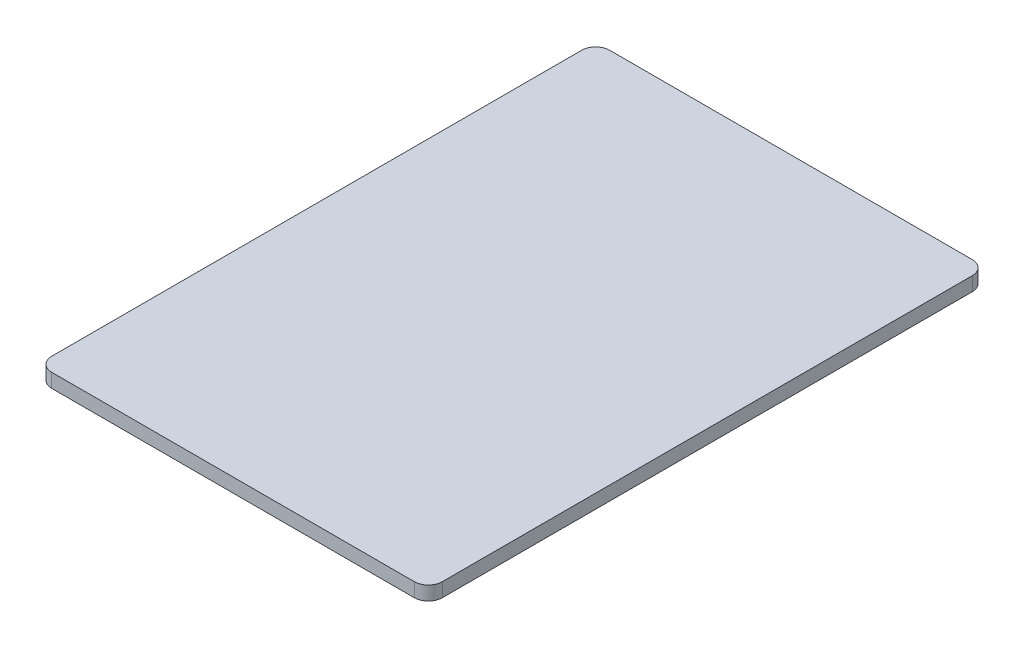
ISO-10303-21;
HEADER;
FILE_DESCRIPTION(('STEP AP214'),'2;1');
FILE_NAME('part.step','',(''),(''),'','','');
FILE_SCHEMA(('AUTOMOTIVE_DESIGN { 1 0 10303 214 1 1 1 1 }'));
ENDSEC;
DATA;
#1=APPLICATION_CONTEXT('core data for automotive mechanical design processes');
#2=APPLICATION_PROTOCOL_DEFINITION('international standard','automotive_design',2000,#1);
#3=PRODUCT_CONTEXT('',#1,'mechanical');
#4=PRODUCT('Part','Part','',(#3));
#5=PRODUCT_RELATED_PRODUCT_CATEGORY('part','',(#4));
#6=PRODUCT_DEFINITION_FORMATION('','',#4);
#7=PRODUCT_DEFINITION_CONTEXT('part definition',#1,'design');
#8=PRODUCT_DEFINITION('design','',#6,#7);
#9=PRODUCT_DEFINITION_SHAPE('','',#8);
#10=(LENGTH_UNIT() NAMED_UNIT(*) SI_UNIT(.MILLI.,.METRE.));
#11=(NAMED_UNIT(*) PLANE_ANGLE_UNIT() SI_UNIT($,.RADIAN.));
#12=(NAMED_UNIT(*) SI_UNIT($,.STERADIAN.) SOLID_ANGLE_UNIT());
#13=UNCERTAINTY_MEASURE_WITH_UNIT(LENGTH_MEASURE(1.E-05),#10,'distance_accuracy_value','');
#14=(GEOMETRIC_REPRESENTATION_CONTEXT(3) GLOBAL_UNCERTAINTY_ASSIGNED_CONTEXT((#13)) GLOBAL_UNIT_ASSIGNED_CONTEXT((#10,
#11,#12)) REPRESENTATION_CONTEXT('',''));
#15=CARTESIAN_POINT('',(0.,0.,0.));
#16=DIRECTION('',(0.,0.,1.));
#17=DIRECTION('',(1.,0.,0.));
#18=AXIS2_PLACEMENT_3D('',#15,#16,#17);
#19=CARTESIAN_POINT('',(-20.6375,1.5875,30.1625));
#20=DIRECTION('',(0.,-1.,0.));
#21=DIRECTION('',(0.,0.,-1.));
#22=AXIS2_PLACEMENT_3D('',#19,#20,#21);
#23=CYLINDRICAL_SURFACE('',#22,1.5875);
#24=CARTESIAN_POINT('',(-20.6375,0.,30.1625));
#25=DIRECTION('',(0.,1.,0.));
#26=DIRECTION('',(0.,0.,-1.));
#27=AXIS2_PLACEMENT_3D('',#24,#25,#26);
#28=CIRCLE('',#27,1.5875);
#29=CARTESIAN_POINT('',(-22.225,0.,30.1625));
#30=VERTEX_POINT('',#29);
#31=CARTESIAN_POINT('',(-20.6375,0.,31.75));
#32=VERTEX_POINT('',#31);
#33=EDGE_CURVE('E131',#30,#32,#28,.T.);
#34=ORIENTED_EDGE('',*,*,#33,.T.);
#35=DIRECTION('',(0.,-1.,0.));
#36=VECTOR('',#35,1.);
#37=CARTESIAN_POINT('',(-20.6375,1.5875,31.75));
#38=LINE('',#37,#36);
#39=CARTESIAN_POINT('',(-20.6375,1.5875,31.75));
#40=VERTEX_POINT('',#39);
#41=EDGE_CURVE('E11',#40,#32,#38,.T.);
#42=ORIENTED_EDGE('',*,*,#41,.F.);
#43=CARTESIAN_POINT('',(-20.6375,1.5875,30.1625));
#44=DIRECTION('',(0.,1.,0.));
#45=DIRECTION('',(0.,0.,-1.));
#46=AXIS2_PLACEMENT_3D('',#43,#44,#45);
#47=CIRCLE('',#46,1.5875);
#48=CARTESIAN_POINT('',(-22.225,1.5875,30.1625));
#49=VERTEX_POINT('',#48);
#50=EDGE_CURVE('E145',#49,#40,#47,.T.);
#51=ORIENTED_EDGE('',*,*,#50,.F.);
#52=DIRECTION('',(0.,-1.,0.));
#53=VECTOR('',#52,1.);
#54=CARTESIAN_POINT('',(-22.225,1.5875,30.1625));
#55=LINE('',#54,#53);
#56=EDGE_CURVE('E127',#49,#30,#55,.T.);
#57=ORIENTED_EDGE('',*,*,#56,.T.);
#58=EDGE_LOOP('',(#34,#42,#51,#57));
#59=FACE_BOUND('',#58,.T.);
#60=ADVANCED_FACE('F35',(#59),#23,.T.);
#61=CARTESIAN_POINT('',(-20.6375,1.5875,31.75));
#62=DIRECTION('',(0.,0.,-1.));
#63=DIRECTION('',(-1.,0.,0.));
#64=AXIS2_PLACEMENT_3D('',#61,#62,#63);
#65=PLANE('',#64);
#66=DIRECTION('',(1.,0.,0.));
#67=VECTOR('',#66,1.);
#68=CARTESIAN_POINT('',(-20.6375,0.,31.75));
#69=LINE('',#68,#67);
#70=CARTESIAN_POINT('',(20.6375,0.,31.75));
#71=VERTEX_POINT('',#70);
#72=EDGE_CURVE('E134',#32,#71,#69,.T.);
#73=ORIENTED_EDGE('',*,*,#72,.T.);
#74=DIRECTION('',(0.,-1.,0.));
#75=VECTOR('',#74,1.);
#76=CARTESIAN_POINT('',(20.6375,1.5875,31.75));
#77=LINE('',#76,#75);
#78=CARTESIAN_POINT('',(20.6375,1.5875,31.75));
#79=VERTEX_POINT('',#78);
#80=EDGE_CURVE('E43',#79,#71,#77,.T.);
#81=ORIENTED_EDGE('',*,*,#80,.F.);
#82=DIRECTION('',(1.,0.,0.));
#83=VECTOR('',#82,1.);
#84=CARTESIAN_POINT('',(-20.6375,1.5875,31.75));
#85=LINE('',#84,#83);
#86=EDGE_CURVE('E94',#40,#79,#85,.T.);
#87=ORIENTED_EDGE('',*,*,#86,.F.);
#88=ORIENTED_EDGE('',*,*,#41,.T.);
#89=EDGE_LOOP('',(#73,#81,#87,#88));
#90=FACE_BOUND('',#89,.T.);
#91=ADVANCED_FACE('F180',(#90),#65,.F.);
#92=CARTESIAN_POINT('',(20.6375,1.5875,30.1625));
#93=DIRECTION('',(0.,-1.,0.));
#94=DIRECTION('',(0.,0.,-1.));
#95=AXIS2_PLACEMENT_3D('',#92,#93,#94);
#96=CYLINDRICAL_SURFACE('',#95,1.5875);
#97=CARTESIAN_POINT('',(20.6375,0.,30.1625));
#98=DIRECTION('',(0.,1.,0.));
#99=DIRECTION('',(0.,0.,1.));
#100=AXIS2_PLACEMENT_3D('',#97,#98,#99);
#101=CIRCLE('',#100,1.5875);
#102=CARTESIAN_POINT('',(22.225,0.,30.1625));
#103=VERTEX_POINT('',#102);
#104=EDGE_CURVE('E136',#71,#103,#101,.T.);
#105=ORIENTED_EDGE('',*,*,#104,.T.);
#106=DIRECTION('',(0.,-1.,0.));
#107=VECTOR('',#106,1.);
#108=CARTESIAN_POINT('',(22.225,1.5875,30.1625));
#109=LINE('',#108,#107);
#110=CARTESIAN_POINT('',(22.225,1.5875,30.1625));
#111=VERTEX_POINT('',#110);
#112=EDGE_CURVE('E152',#111,#103,#109,.T.);
#113=ORIENTED_EDGE('',*,*,#112,.F.);
#114=CARTESIAN_POINT('',(20.6375,1.5875,30.1625));
#115=DIRECTION('',(0.,1.,0.));
#116=DIRECTION('',(0.,0.,1.));
#117=AXIS2_PLACEMENT_3D('',#114,#115,#116);
#118=CIRCLE('',#117,1.5875);
#119=EDGE_CURVE('E160',#79,#111,#118,.T.);
#120=ORIENTED_EDGE('',*,*,#119,.F.);
#121=ORIENTED_EDGE('',*,*,#80,.T.);
#122=EDGE_LOOP('',(#105,#113,#120,#121));
#123=FACE_BOUND('',#122,.T.);
#124=ADVANCED_FACE('F158',(#123),#96,.T.);
#125=CARTESIAN_POINT('',(22.225,1.5875,30.1625));
#126=DIRECTION('',(-1.,0.,0.));
#127=DIRECTION('',(0.,0.,1.));
#128=AXIS2_PLACEMENT_3D('',#125,#126,#127);
#129=PLANE('',#128);
#130=DIRECTION('',(0.,0.,-1.));
#131=VECTOR('',#130,1.);
#132=CARTESIAN_POINT('',(22.225,0.,30.1625));
#133=LINE('',#132,#131);
#134=CARTESIAN_POINT('',(22.225,0.,-30.1625));
#135=VERTEX_POINT('',#134);
#136=EDGE_CURVE('E138',#103,#135,#133,.T.);
#137=ORIENTED_EDGE('',*,*,#136,.T.);
#138=DIRECTION('',(0.,-1.,0.));
#139=VECTOR('',#138,1.);
#140=CARTESIAN_POINT('',(22.225,1.5875,-30.1625));
#141=LINE('',#140,#139);
#142=CARTESIAN_POINT('',(22.225,1.5875,-30.1625));
#143=VERTEX_POINT('',#142);
#144=EDGE_CURVE('E149',#143,#135,#141,.T.);
#145=ORIENTED_EDGE('',*,*,#144,.F.);
#146=DIRECTION('',(0.,0.,-1.));
#147=VECTOR('',#146,1.);
#148=CARTESIAN_POINT('',(22.225,1.5875,30.1625));
#149=LINE('',#148,#147);
#150=EDGE_CURVE('E172',#111,#143,#149,.T.);
#151=ORIENTED_EDGE('',*,*,#150,.F.);
#152=ORIENTED_EDGE('',*,*,#112,.T.);
#153=EDGE_LOOP('',(#137,#145,#151,#152));
#154=FACE_BOUND('',#153,.T.);
#155=ADVANCED_FACE('F168',(#154),#129,.F.);
#156=CARTESIAN_POINT('',(20.6375,1.5875,-30.1625));
#157=DIRECTION('',(0.,-1.,0.));
#158=DIRECTION('',(0.,0.,-1.));
#159=AXIS2_PLACEMENT_3D('',#156,#157,#158);
#160=CYLINDRICAL_SURFACE('',#159,1.5875);
#161=CARTESIAN_POINT('',(20.6375,0.,-30.1625));
#162=DIRECTION('',(0.,1.,0.));
#163=DIRECTION('',(0.,0.,1.));
#164=AXIS2_PLACEMENT_3D('',#161,#162,#163);
#165=CIRCLE('',#164,1.5875);
#166=CARTESIAN_POINT('',(20.6375,0.,-31.75));
#167=VERTEX_POINT('',#166);
#168=EDGE_CURVE('E140',#135,#167,#165,.T.);
#169=ORIENTED_EDGE('',*,*,#168,.T.);
#170=DIRECTION('',(0.,-1.,0.));
#171=VECTOR('',#170,1.);
#172=CARTESIAN_POINT('',(20.6375,1.5875,-31.75));
#173=LINE('',#172,#171);
#174=CARTESIAN_POINT('',(20.6375,1.5875,-31.75));
#175=VERTEX_POINT('',#174);
#176=EDGE_CURVE('E122',#175,#167,#173,.T.);
#177=ORIENTED_EDGE('',*,*,#176,.F.);
#178=CARTESIAN_POINT('',(20.6375,1.5875,-30.1625));
#179=DIRECTION('',(0.,1.,0.));
#180=DIRECTION('',(0.,0.,1.));
#181=AXIS2_PLACEMENT_3D('',#178,#179,#180);
#182=CIRCLE('',#181,1.5875);
#183=EDGE_CURVE('E113',#143,#175,#182,.T.);
#184=ORIENTED_EDGE('',*,*,#183,.F.);
#185=ORIENTED_EDGE('',*,*,#144,.T.);
#186=EDGE_LOOP('',(#169,#177,#184,#185));
#187=FACE_BOUND('',#186,.T.);
#188=ADVANCED_FACE('F171',(#187),#160,.T.);
#189=CARTESIAN_POINT('',(-20.6375,1.5875,-31.75));
#190=DIRECTION('',(0.,0.,1.));
#191=DIRECTION('',(1.,0.,0.));
#192=AXIS2_PLACEMENT_3D('',#189,#190,#191);
#193=PLANE('',#192);
#194=DIRECTION('',(-1.,0.,0.));
#195=VECTOR('',#194,1.);
#196=CARTESIAN_POINT('',(-20.6375,0.,-31.75));
#197=LINE('',#196,#195);
#198=CARTESIAN_POINT('',(-20.6375,0.,-31.75));
#199=VERTEX_POINT('',#198);
#200=EDGE_CURVE('E121',#167,#199,#197,.T.);
#201=ORIENTED_EDGE('',*,*,#200,.T.);
#202=DIRECTION('',(0.,-1.,0.));
#203=VECTOR('',#202,1.);
#204=CARTESIAN_POINT('',(-20.6375,1.5875,-31.75));
#205=LINE('',#204,#203);
#206=CARTESIAN_POINT('',(-20.6375,1.5875,-31.75));
#207=VERTEX_POINT('',#206);
#208=EDGE_CURVE('E118',#207,#199,#205,.T.);
#209=ORIENTED_EDGE('',*,*,#208,.F.);
#210=DIRECTION('',(-1.,0.,0.));
#211=VECTOR('',#210,1.);
#212=CARTESIAN_POINT('',(-20.6375,1.5875,-31.75));
#213=LINE('',#212,#211);
#214=EDGE_CURVE('E107',#175,#207,#213,.T.);
#215=ORIENTED_EDGE('',*,*,#214,.F.);
#216=ORIENTED_EDGE('',*,*,#176,.T.);
#217=EDGE_LOOP('',(#201,#209,#215,#216));
#218=FACE_BOUND('',#217,.T.);
#219=ADVANCED_FACE('F119',(#218),#193,.F.);
#220=CARTESIAN_POINT('',(-20.6375,1.5875,-30.1625));
#221=DIRECTION('',(0.,-1.,0.));
#222=DIRECTION('',(0.,0.,-1.));
#223=AXIS2_PLACEMENT_3D('',#220,#221,#222);
#224=CYLINDRICAL_SURFACE('',#223,1.5875);
#225=CARTESIAN_POINT('',(-20.6375,0.,-30.1625));
#226=DIRECTION('',(0.,1.,0.));
#227=DIRECTION('',(0.,0.,-1.));
#228=AXIS2_PLACEMENT_3D('',#225,#226,#227);
#229=CIRCLE('',#228,1.5875);
#230=CARTESIAN_POINT('',(-22.225,0.,-30.1625));
#231=VERTEX_POINT('',#230);
#232=EDGE_CURVE('E80',#199,#231,#229,.T.);
#233=ORIENTED_EDGE('',*,*,#232,.T.);
#234=DIRECTION('',(0.,-1.,0.));
#235=VECTOR('',#234,1.);
#236=CARTESIAN_POINT('',(-22.225,1.5875,-30.1625));
#237=LINE('',#236,#235);
#238=CARTESIAN_POINT('',(-22.225,1.5875,-30.1625));
#239=VERTEX_POINT('',#238);
#240=EDGE_CURVE('E123',#239,#231,#237,.T.);
#241=ORIENTED_EDGE('',*,*,#240,.F.);
#242=CARTESIAN_POINT('',(-20.6375,1.5875,-30.1625));
#243=DIRECTION('',(0.,1.,0.));
#244=DIRECTION('',(0.,0.,-1.));
#245=AXIS2_PLACEMENT_3D('',#242,#243,#244);
#246=CIRCLE('',#245,1.5875);
#247=EDGE_CURVE('E111',#207,#239,#246,.T.);
#248=ORIENTED_EDGE('',*,*,#247,.F.);
#249=ORIENTED_EDGE('',*,*,#208,.T.);
#250=EDGE_LOOP('',(#233,#241,#248,#249));
#251=FACE_BOUND('',#250,.T.);
#252=ADVANCED_FACE('F125',(#251),#224,.T.);
#253=CARTESIAN_POINT('',(-22.225,1.5875,30.1625));
#254=DIRECTION('',(1.,0.,0.));
#255=DIRECTION('',(0.,0.,-1.));
#256=AXIS2_PLACEMENT_3D('',#253,#254,#255);
#257=PLANE('',#256);
#258=DIRECTION('',(0.,0.,1.));
#259=VECTOR('',#258,1.);
#260=CARTESIAN_POINT('',(-22.225,0.,30.1625));
#261=LINE('',#260,#259);
#262=EDGE_CURVE('E86',#231,#30,#261,.T.);
#263=ORIENTED_EDGE('',*,*,#262,.T.);
#264=ORIENTED_EDGE('',*,*,#56,.F.);
#265=DIRECTION('',(0.,0.,1.));
#266=VECTOR('',#265,1.);
#267=CARTESIAN_POINT('',(-22.225,1.5875,30.1625));
#268=LINE('',#267,#266);
#269=EDGE_CURVE('E51',#239,#49,#268,.T.);
#270=ORIENTED_EDGE('',*,*,#269,.F.);
#271=ORIENTED_EDGE('',*,*,#240,.T.);
#272=EDGE_LOOP('',(#263,#264,#270,#271));
#273=FACE_BOUND('',#272,.T.);
#274=ADVANCED_FACE('F196',(#273),#257,.F.);
#275=CARTESIAN_POINT('',(-20.6375,1.5875,30.1625));
#276=DIRECTION('',(0.,-1.,0.));
#277=DIRECTION('',(0.,0.,-1.));
#278=AXIS2_PLACEMENT_3D('',#275,#276,#277);
#279=PLANE('',#278);
#280=ORIENTED_EDGE('',*,*,#50,.T.);
#281=ORIENTED_EDGE('',*,*,#86,.T.);
#282=ORIENTED_EDGE('',*,*,#119,.T.);
#283=ORIENTED_EDGE('',*,*,#150,.T.);
#284=ORIENTED_EDGE('',*,*,#183,.T.);
#285=ORIENTED_EDGE('',*,*,#214,.T.);
#286=ORIENTED_EDGE('',*,*,#247,.T.);
#287=ORIENTED_EDGE('',*,*,#269,.T.);
#288=EDGE_LOOP('',(#280,#281,#282,#283,#284,#285,#286,#287));
#289=FACE_BOUND('',#288,.T.);
#290=ADVANCED_FACE('F109',(#289),#279,.F.);
#291=CARTESIAN_POINT('',(-20.6375,0.,30.1625));
#292=DIRECTION('',(0.,-1.,0.));
#293=DIRECTION('',(0.,0.,-1.));
#294=AXIS2_PLACEMENT_3D('',#291,#292,#293);
#295=PLANE('',#294);
#296=ORIENTED_EDGE('',*,*,#33,.F.);
#297=ORIENTED_EDGE('',*,*,#262,.F.);
#298=ORIENTED_EDGE('',*,*,#232,.F.);
#299=ORIENTED_EDGE('',*,*,#200,.F.);
#300=ORIENTED_EDGE('',*,*,#168,.F.);
#301=ORIENTED_EDGE('',*,*,#136,.F.);
#302=ORIENTED_EDGE('',*,*,#104,.F.);
#303=ORIENTED_EDGE('',*,*,#72,.F.);
#304=EDGE_LOOP('',(#296,#297,#298,#299,#300,#301,#302,#303));
#305=FACE_BOUND('',#304,.T.);
#306=ADVANCED_FACE('F164',(#305),#295,.T.);
#307=CLOSED_SHELL('',(#60,#91,#124,#155,#188,#219,#252,#274,#290,#306));
#308=MANIFOLD_SOLID_BREP('B2',#307);
#309=ADVANCED_BREP_SHAPE_REPRESENTATION('',(#18,#308),#14);
#310=SHAPE_DEFINITION_REPRESENTATION(#9,#309);
ENDSEC;
END-ISO-10303-21;
